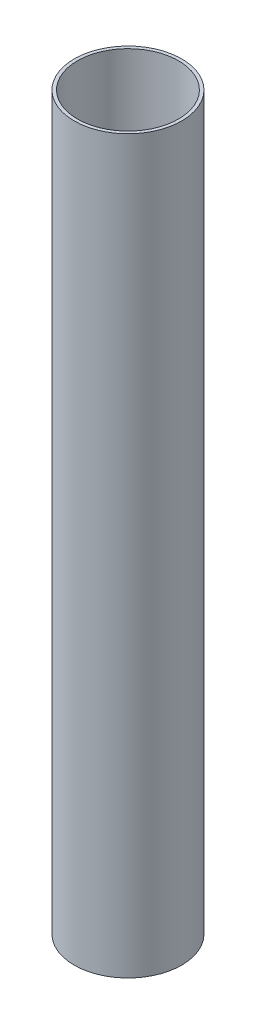
ISO-10303-21;
HEADER;
FILE_DESCRIPTION(('STEP AP214'),'2;1');
FILE_NAME('part.step','',(''),(''),'','','');
FILE_SCHEMA(('AUTOMOTIVE_DESIGN { 1 0 10303 214 1 1 1 1 }'));
ENDSEC;
DATA;
#1=APPLICATION_CONTEXT('core data for automotive mechanical design processes');
#2=APPLICATION_PROTOCOL_DEFINITION('international standard','automotive_design',2000,#1);
#3=PRODUCT_CONTEXT('',#1,'mechanical');
#4=PRODUCT('Part','Part','',(#3));
#5=PRODUCT_RELATED_PRODUCT_CATEGORY('part','',(#4));
#6=PRODUCT_DEFINITION_FORMATION('','',#4);
#7=PRODUCT_DEFINITION_CONTEXT('part definition',#1,'design');
#8=PRODUCT_DEFINITION('design','',#6,#7);
#9=PRODUCT_DEFINITION_SHAPE('','',#8);
#10=(LENGTH_UNIT() NAMED_UNIT(*) SI_UNIT(.MILLI.,.METRE.));
#11=(NAMED_UNIT(*) PLANE_ANGLE_UNIT() SI_UNIT($,.RADIAN.));
#12=(NAMED_UNIT(*) SI_UNIT($,.STERADIAN.) SOLID_ANGLE_UNIT());
#13=UNCERTAINTY_MEASURE_WITH_UNIT(LENGTH_MEASURE(1.E-05),#10,'distance_accuracy_value','');
#14=(GEOMETRIC_REPRESENTATION_CONTEXT(3) GLOBAL_UNCERTAINTY_ASSIGNED_CONTEXT((#13)) GLOBAL_UNIT_ASSIGNED_CONTEXT((#10,
#11,#12)) REPRESENTATION_CONTEXT('',''));
#15=CARTESIAN_POINT('',(0.,0.,0.));
#16=DIRECTION('',(0.,0.,1.));
#17=DIRECTION('',(1.,0.,0.));
#18=AXIS2_PLACEMENT_3D('',#15,#16,#17);
#19=CARTESIAN_POINT('',(0.,680.,0.));
#20=DIRECTION('',(0.,1.,0.));
#21=DIRECTION('',(0.,0.,1.));
#22=AXIS2_PLACEMENT_3D('',#19,#20,#21);
#23=PLANE('',#22);
#24=CARTESIAN_POINT('',(0.,680.,0.));
#25=DIRECTION('',(0.,1.,0.));
#26=DIRECTION('',(0.,0.,1.));
#27=AXIS2_PLACEMENT_3D('',#24,#25,#26);
#28=CIRCLE('',#27,50.);
#29=CARTESIAN_POINT('',(0.,680.,50.));
#30=VERTEX_POINT('',#29);
#31=EDGE_CURVE('E10',#30,#30,#28,.T.);
#32=ORIENTED_EDGE('',*,*,#31,.T.);
#33=EDGE_LOOP('',(#32));
#34=FACE_BOUND('',#33,.T.);
#35=CARTESIAN_POINT('',(0.,680.,0.));
#36=DIRECTION('',(0.,1.,0.));
#37=DIRECTION('',(0.,0.,1.));
#38=AXIS2_PLACEMENT_3D('',#35,#36,#37);
#39=CIRCLE('',#38,47.);
#40=CARTESIAN_POINT('',(0.,680.,47.));
#41=VERTEX_POINT('',#40);
#42=EDGE_CURVE('E48',#41,#41,#39,.T.);
#43=ORIENTED_EDGE('',*,*,#42,.F.);
#44=EDGE_LOOP('',(#43));
#45=FACE_BOUND('',#44,.T.);
#46=ADVANCED_FACE('F37',(#34,#45),#23,.T.);
#47=CARTESIAN_POINT('',(0.,0.,0.));
#48=DIRECTION('',(0.,1.,0.));
#49=DIRECTION('',(0.,0.,1.));
#50=AXIS2_PLACEMENT_3D('',#47,#48,#49);
#51=PLANE('',#50);
#52=CARTESIAN_POINT('',(0.,0.,0.));
#53=DIRECTION('',(0.,1.,0.));
#54=DIRECTION('',(0.,0.,1.));
#55=AXIS2_PLACEMENT_3D('',#52,#53,#54);
#56=CIRCLE('',#55,50.);
#57=CARTESIAN_POINT('',(0.,0.,50.));
#58=VERTEX_POINT('',#57);
#59=EDGE_CURVE('E41',#58,#58,#56,.T.);
#60=ORIENTED_EDGE('',*,*,#59,.F.);
#61=EDGE_LOOP('',(#60));
#62=FACE_BOUND('',#61,.T.);
#63=CARTESIAN_POINT('',(0.,0.,0.));
#64=DIRECTION('',(0.,1.,0.));
#65=DIRECTION('',(0.,0.,1.));
#66=AXIS2_PLACEMENT_3D('',#63,#64,#65);
#67=CIRCLE('',#66,47.);
#68=CARTESIAN_POINT('',(0.,0.,47.));
#69=VERTEX_POINT('',#68);
#70=EDGE_CURVE('E50',#69,#69,#67,.T.);
#71=ORIENTED_EDGE('',*,*,#70,.T.);
#72=EDGE_LOOP('',(#71));
#73=FACE_BOUND('',#72,.T.);
#74=ADVANCED_FACE('F60',(#62,#73),#51,.F.);
#75=CARTESIAN_POINT('',(0.,680.,0.));
#76=DIRECTION('',(0.,-1.,0.));
#77=DIRECTION('',(0.,0.,-1.));
#78=AXIS2_PLACEMENT_3D('',#75,#76,#77);
#79=CYLINDRICAL_SURFACE('',#78,50.);
#80=ORIENTED_EDGE('',*,*,#31,.F.);
#81=EDGE_LOOP('',(#80));
#82=FACE_BOUND('',#81,.T.);
#83=ORIENTED_EDGE('',*,*,#59,.T.);
#84=EDGE_LOOP('',(#83));
#85=FACE_BOUND('',#84,.T.);
#86=ADVANCED_FACE('F39',(#82,#85),#79,.T.);
#87=CARTESIAN_POINT('',(0.,680.,0.));
#88=DIRECTION('',(0.,-1.,0.));
#89=DIRECTION('',(0.,0.,-1.));
#90=AXIS2_PLACEMENT_3D('',#87,#88,#89);
#91=CYLINDRICAL_SURFACE('',#90,47.);
#92=ORIENTED_EDGE('',*,*,#42,.T.);
#93=EDGE_LOOP('',(#92));
#94=FACE_BOUND('',#93,.T.);
#95=ORIENTED_EDGE('',*,*,#70,.F.);
#96=EDGE_LOOP('',(#95));
#97=FACE_BOUND('',#96,.T.);
#98=ADVANCED_FACE('F56',(#94,#97),#91,.F.);
#99=CLOSED_SHELL('',(#46,#74,#86,#98));
#100=MANIFOLD_SOLID_BREP('B2',#99);
#101=ADVANCED_BREP_SHAPE_REPRESENTATION('',(#18,#100),#14);
#102=SHAPE_DEFINITION_REPRESENTATION(#9,#101);
ENDSEC;
END-ISO-10303-21;
